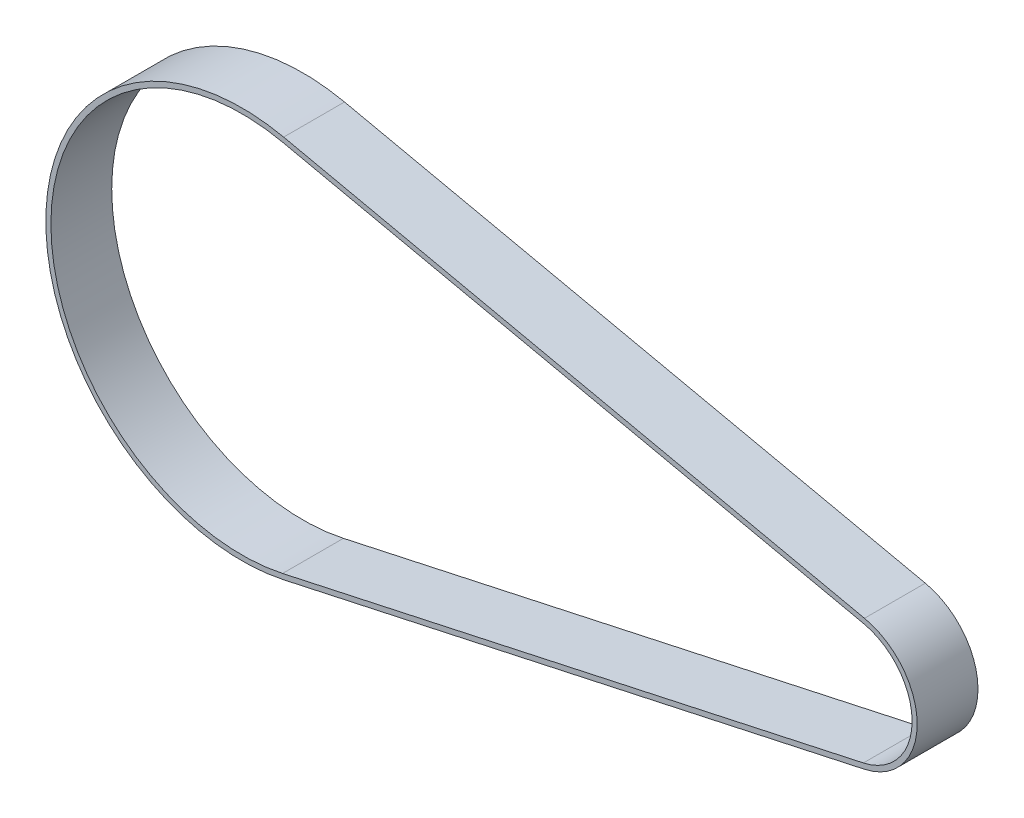
ISO-10303-21;
HEADER;
FILE_DESCRIPTION(('STEP AP214'),'2;1');
FILE_NAME('part.step','',(''),(''),'','','');
FILE_SCHEMA(('AUTOMOTIVE_DESIGN { 1 0 10303 214 1 1 1 1 }'));
ENDSEC;
DATA;
#1=APPLICATION_CONTEXT('core data for automotive mechanical design processes');
#2=APPLICATION_PROTOCOL_DEFINITION('international standard','automotive_design',2000,#1);
#3=PRODUCT_CONTEXT('',#1,'mechanical');
#4=PRODUCT('Part','Part','',(#3));
#5=PRODUCT_RELATED_PRODUCT_CATEGORY('part','',(#4));
#6=PRODUCT_DEFINITION_FORMATION('','',#4);
#7=PRODUCT_DEFINITION_CONTEXT('part definition',#1,'design');
#8=PRODUCT_DEFINITION('design','',#6,#7);
#9=PRODUCT_DEFINITION_SHAPE('','',#8);
#10=(LENGTH_UNIT() NAMED_UNIT(*) SI_UNIT(.MILLI.,.METRE.));
#11=(NAMED_UNIT(*) PLANE_ANGLE_UNIT() SI_UNIT($,.RADIAN.));
#12=(NAMED_UNIT(*) SI_UNIT($,.STERADIAN.) SOLID_ANGLE_UNIT());
#13=UNCERTAINTY_MEASURE_WITH_UNIT(LENGTH_MEASURE(1.E-05),#10,'distance_accuracy_value','');
#14=(GEOMETRIC_REPRESENTATION_CONTEXT(3) GLOBAL_UNCERTAINTY_ASSIGNED_CONTEXT((#13)) GLOBAL_UNIT_ASSIGNED_CONTEXT((#10,
#11,#12)) REPRESENTATION_CONTEXT('',''));
#15=CARTESIAN_POINT('',(0.,0.,0.));
#16=DIRECTION('',(0.,0.,1.));
#17=DIRECTION('',(1.,0.,0.));
#18=AXIS2_PLACEMENT_3D('',#15,#16,#17);
#19=CARTESIAN_POINT('',(0.,0.,6.));
#20=DIRECTION('',(0.,0.,1.));
#21=DIRECTION('',(1.,0.,0.));
#22=AXIS2_PLACEMENT_3D('',#19,#20,#21);
#23=PLANE('',#22);
#24=CARTESIAN_POINT('',(0.,0.,6.));
#25=DIRECTION('',(0.,0.,1.));
#26=DIRECTION('',(1.,0.,0.));
#27=AXIS2_PLACEMENT_3D('',#24,#25,#26);
#28=CIRCLE('',#27,19.35);
#29=CARTESIAN_POINT('',(4.111875,18.9080666379293,6.));
#30=VERTEX_POINT('',#29);
#31=CARTESIAN_POINT('',(4.111875,-18.9080666379293,6.));
#32=VERTEX_POINT('',#31);
#33=EDGE_CURVE('E134',#30,#32,#28,.T.);
#34=ORIENTED_EDGE('',*,*,#33,.T.);
#35=DIRECTION('',(0.977161066559654,0.2125,0.));
#36=VECTOR('',#35,1.);
#37=CARTESIAN_POINT('',(61.4025,-6.44926303929371,6.));
#38=LINE('',#37,#36);
#39=CARTESIAN_POINT('',(61.4025,-6.44926303929371,6.));
#40=VERTEX_POINT('',#39);
#41=EDGE_CURVE('E137',#32,#40,#38,.T.);
#42=ORIENTED_EDGE('',*,*,#41,.T.);
#43=CARTESIAN_POINT('',(60.,0.,6.));
#44=DIRECTION('',(0.,0.,1.));
#45=DIRECTION('',(1.,0.,0.));
#46=AXIS2_PLACEMENT_3D('',#43,#44,#45);
#47=CIRCLE('',#46,6.6);
#48=CARTESIAN_POINT('',(61.4025,6.44926303929371,6.));
#49=VERTEX_POINT('',#48);
#50=EDGE_CURVE('E140',#40,#49,#47,.T.);
#51=ORIENTED_EDGE('',*,*,#50,.T.);
#52=DIRECTION('',(-0.977161066559654,0.2125,0.));
#53=VECTOR('',#52,1.);
#54=CARTESIAN_POINT('',(4.111875,18.9080666379293,6.));
#55=LINE('',#54,#53);
#56=EDGE_CURVE('E142',#49,#30,#55,.T.);
#57=ORIENTED_EDGE('',*,*,#56,.T.);
#58=EDGE_LOOP('',(#34,#42,#51,#57));
#59=FACE_BOUND('',#58,.T.);
#60=DIRECTION('',(0.977161066559654,0.2125,0.));
#61=VECTOR('',#60,1.);
#62=CARTESIAN_POINT('',(61.29625,-5.96068250601389,6.));
#63=LINE('',#62,#61);
#64=CARTESIAN_POINT('',(4.005625,-18.4194861046495,6.));
#65=VERTEX_POINT('',#64);
#66=CARTESIAN_POINT('',(61.29625,-5.96068250601389,6.));
#67=VERTEX_POINT('',#66);
#68=EDGE_CURVE('E106',#65,#67,#63,.T.);
#69=ORIENTED_EDGE('',*,*,#68,.F.);
#70=CARTESIAN_POINT('',(0.,0.,6.));
#71=DIRECTION('',(0.,0.,1.));
#72=DIRECTION('',(1.,0.,0.));
#73=AXIS2_PLACEMENT_3D('',#70,#71,#72);
#74=CIRCLE('',#73,18.85);
#75=CARTESIAN_POINT('',(4.005625,18.4194861046495,6.));
#76=VERTEX_POINT('',#75);
#77=EDGE_CURVE('E98',#76,#65,#74,.T.);
#78=ORIENTED_EDGE('',*,*,#77,.F.);
#79=DIRECTION('',(-0.977161066559654,0.2125,0.));
#80=VECTOR('',#79,1.);
#81=CARTESIAN_POINT('',(4.005625,18.4194861046495,6.));
#82=LINE('',#81,#80);
#83=CARTESIAN_POINT('',(61.29625,5.96068250601389,6.));
#84=VERTEX_POINT('',#83);
#85=EDGE_CURVE('E120',#84,#76,#82,.T.);
#86=ORIENTED_EDGE('',*,*,#85,.F.);
#87=CARTESIAN_POINT('',(60.,0.,6.));
#88=DIRECTION('',(0.,0.,1.));
#89=DIRECTION('',(1.,0.,0.));
#90=AXIS2_PLACEMENT_3D('',#87,#88,#89);
#91=CIRCLE('',#90,6.1);
#92=EDGE_CURVE('E118',#67,#84,#91,.T.);
#93=ORIENTED_EDGE('',*,*,#92,.F.);
#94=EDGE_LOOP('',(#69,#78,#86,#93));
#95=FACE_BOUND('',#94,.T.);
#96=ADVANCED_FACE('F33',(#59,#95),#23,.T.);
#97=CARTESIAN_POINT('',(0.,0.,0.));
#98=DIRECTION('',(0.,0.,1.));
#99=DIRECTION('',(1.,0.,0.));
#100=AXIS2_PLACEMENT_3D('',#97,#98,#99);
#101=PLANE('',#100);
#102=CARTESIAN_POINT('',(0.,0.,0.));
#103=DIRECTION('',(0.,0.,1.));
#104=DIRECTION('',(1.,0.,0.));
#105=AXIS2_PLACEMENT_3D('',#102,#103,#104);
#106=CIRCLE('',#105,19.35);
#107=CARTESIAN_POINT('',(4.111875,18.9080666379293,0.));
#108=VERTEX_POINT('',#107);
#109=CARTESIAN_POINT('',(4.111875,-18.9080666379293,0.));
#110=VERTEX_POINT('',#109);
#111=EDGE_CURVE('E114',#108,#110,#106,.T.);
#112=ORIENTED_EDGE('',*,*,#111,.F.);
#113=DIRECTION('',(-0.977161066559654,0.2125,0.));
#114=VECTOR('',#113,1.);
#115=CARTESIAN_POINT('',(4.111875,18.9080666379293,0.));
#116=LINE('',#115,#114);
#117=CARTESIAN_POINT('',(61.4025,6.44926303929371,0.));
#118=VERTEX_POINT('',#117);
#119=EDGE_CURVE('E138',#118,#108,#116,.T.);
#120=ORIENTED_EDGE('',*,*,#119,.F.);
#121=CARTESIAN_POINT('',(60.,0.,0.));
#122=DIRECTION('',(0.,0.,1.));
#123=DIRECTION('',(1.,0.,0.));
#124=AXIS2_PLACEMENT_3D('',#121,#122,#123);
#125=CIRCLE('',#124,6.6);
#126=CARTESIAN_POINT('',(61.4025,-6.44926303929371,0.));
#127=VERTEX_POINT('',#126);
#128=EDGE_CURVE('E149',#127,#118,#125,.T.);
#129=ORIENTED_EDGE('',*,*,#128,.F.);
#130=DIRECTION('',(0.977161066559654,0.2125,0.));
#131=VECTOR('',#130,1.);
#132=CARTESIAN_POINT('',(61.4025,-6.44926303929371,0.));
#133=LINE('',#132,#131);
#134=EDGE_CURVE('E147',#110,#127,#133,.T.);
#135=ORIENTED_EDGE('',*,*,#134,.F.);
#136=EDGE_LOOP('',(#112,#120,#129,#135));
#137=FACE_BOUND('',#136,.T.);
#138=CARTESIAN_POINT('',(0.,0.,0.));
#139=DIRECTION('',(0.,0.,1.));
#140=DIRECTION('',(1.,0.,0.));
#141=AXIS2_PLACEMENT_3D('',#138,#139,#140);
#142=CIRCLE('',#141,18.85);
#143=CARTESIAN_POINT('',(4.005625,18.4194861046495,0.));
#144=VERTEX_POINT('',#143);
#145=CARTESIAN_POINT('',(4.005625,-18.4194861046495,0.));
#146=VERTEX_POINT('',#145);
#147=EDGE_CURVE('E56',#144,#146,#142,.T.);
#148=ORIENTED_EDGE('',*,*,#147,.T.);
#149=DIRECTION('',(0.977161066559654,0.2125,0.));
#150=VECTOR('',#149,1.);
#151=CARTESIAN_POINT('',(61.29625,-5.96068250601389,0.));
#152=LINE('',#151,#150);
#153=CARTESIAN_POINT('',(61.29625,-5.96068250601389,0.));
#154=VERTEX_POINT('',#153);
#155=EDGE_CURVE('E113',#146,#154,#152,.T.);
#156=ORIENTED_EDGE('',*,*,#155,.T.);
#157=CARTESIAN_POINT('',(60.,0.,0.));
#158=DIRECTION('',(0.,0.,1.));
#159=DIRECTION('',(1.,0.,0.));
#160=AXIS2_PLACEMENT_3D('',#157,#158,#159);
#161=CIRCLE('',#160,6.1);
#162=CARTESIAN_POINT('',(61.29625,5.96068250601389,0.));
#163=VERTEX_POINT('',#162);
#164=EDGE_CURVE('E126',#154,#163,#161,.T.);
#165=ORIENTED_EDGE('',*,*,#164,.T.);
#166=DIRECTION('',(-0.977161066559654,0.2125,0.));
#167=VECTOR('',#166,1.);
#168=CARTESIAN_POINT('',(4.005625,18.4194861046495,0.));
#169=LINE('',#168,#167);
#170=EDGE_CURVE('E107',#163,#144,#169,.T.);
#171=ORIENTED_EDGE('',*,*,#170,.T.);
#172=EDGE_LOOP('',(#148,#156,#165,#171));
#173=FACE_BOUND('',#172,.T.);
#174=ADVANCED_FACE('F167',(#137,#173),#101,.F.);
#175=CARTESIAN_POINT('',(0.,0.,6.));
#176=DIRECTION('',(0.,0.,-1.));
#177=DIRECTION('',(-1.,0.,0.));
#178=AXIS2_PLACEMENT_3D('',#175,#176,#177);
#179=CYLINDRICAL_SURFACE('',#178,19.35);
#180=ORIENTED_EDGE('',*,*,#111,.T.);
#181=DIRECTION('',(0.,0.,-1.));
#182=VECTOR('',#181,1.);
#183=CARTESIAN_POINT('',(4.111875,-18.9080666379293,6.));
#184=LINE('',#183,#182);
#185=EDGE_CURVE('E11',#32,#110,#184,.T.);
#186=ORIENTED_EDGE('',*,*,#185,.F.);
#187=ORIENTED_EDGE('',*,*,#33,.F.);
#188=DIRECTION('',(0.,0.,-1.));
#189=VECTOR('',#188,1.);
#190=CARTESIAN_POINT('',(4.111875,18.9080666379293,6.));
#191=LINE('',#190,#189);
#192=EDGE_CURVE('E144',#30,#108,#191,.T.);
#193=ORIENTED_EDGE('',*,*,#192,.T.);
#194=EDGE_LOOP('',(#180,#186,#187,#193));
#195=FACE_BOUND('',#194,.T.);
#196=ADVANCED_FACE('F35',(#195),#179,.T.);
#197=CARTESIAN_POINT('',(61.4025,-6.44926303929371,6.));
#198=DIRECTION('',(-0.2125,0.977161066559654,0.));
#199=DIRECTION('',(-0.977161066559654,-0.2125,0.));
#200=AXIS2_PLACEMENT_3D('',#197,#198,#199);
#201=PLANE('',#200);
#202=ORIENTED_EDGE('',*,*,#134,.T.);
#203=DIRECTION('',(0.,0.,-1.));
#204=VECTOR('',#203,1.);
#205=CARTESIAN_POINT('',(61.4025,-6.44926303929371,6.));
#206=LINE('',#205,#204);
#207=EDGE_CURVE('E41',#40,#127,#206,.T.);
#208=ORIENTED_EDGE('',*,*,#207,.F.);
#209=ORIENTED_EDGE('',*,*,#41,.F.);
#210=ORIENTED_EDGE('',*,*,#185,.T.);
#211=EDGE_LOOP('',(#202,#208,#209,#210));
#212=FACE_BOUND('',#211,.T.);
#213=ADVANCED_FACE('F177',(#212),#201,.F.);
#214=CARTESIAN_POINT('',(60.,0.,6.));
#215=DIRECTION('',(0.,0.,-1.));
#216=DIRECTION('',(-1.,0.,0.));
#217=AXIS2_PLACEMENT_3D('',#214,#215,#216);
#218=CYLINDRICAL_SURFACE('',#217,6.6);
#219=ORIENTED_EDGE('',*,*,#128,.T.);
#220=DIRECTION('',(0.,0.,-1.));
#221=VECTOR('',#220,1.);
#222=CARTESIAN_POINT('',(61.4025,6.44926303929371,6.));
#223=LINE('',#222,#221);
#224=EDGE_CURVE('E154',#49,#118,#223,.T.);
#225=ORIENTED_EDGE('',*,*,#224,.F.);
#226=ORIENTED_EDGE('',*,*,#50,.F.);
#227=ORIENTED_EDGE('',*,*,#207,.T.);
#228=EDGE_LOOP('',(#219,#225,#226,#227));
#229=FACE_BOUND('',#228,.T.);
#230=ADVANCED_FACE('F161',(#229),#218,.T.);
#231=CARTESIAN_POINT('',(4.111875,18.9080666379293,6.));
#232=DIRECTION('',(-0.2125,-0.977161066559654,0.));
#233=DIRECTION('',(0.977161066559654,-0.2125,0.));
#234=AXIS2_PLACEMENT_3D('',#231,#232,#233);
#235=PLANE('',#234);
#236=ORIENTED_EDGE('',*,*,#119,.T.);
#237=ORIENTED_EDGE('',*,*,#192,.F.);
#238=ORIENTED_EDGE('',*,*,#56,.F.);
#239=ORIENTED_EDGE('',*,*,#224,.T.);
#240=EDGE_LOOP('',(#236,#237,#238,#239));
#241=FACE_BOUND('',#240,.T.);
#242=ADVANCED_FACE('F171',(#241),#235,.F.);
#243=CARTESIAN_POINT('',(0.,0.,6.));
#244=DIRECTION('',(0.,0.,-1.));
#245=DIRECTION('',(-1.,0.,0.));
#246=AXIS2_PLACEMENT_3D('',#243,#244,#245);
#247=CYLINDRICAL_SURFACE('',#246,18.85);
#248=ORIENTED_EDGE('',*,*,#147,.F.);
#249=DIRECTION('',(0.,0.,-1.));
#250=VECTOR('',#249,1.);
#251=CARTESIAN_POINT('',(4.005625,18.4194861046495,6.));
#252=LINE('',#251,#250);
#253=EDGE_CURVE('E102',#76,#144,#252,.T.);
#254=ORIENTED_EDGE('',*,*,#253,.F.);
#255=ORIENTED_EDGE('',*,*,#77,.T.);
#256=DIRECTION('',(0.,0.,-1.));
#257=VECTOR('',#256,1.);
#258=CARTESIAN_POINT('',(4.005625,-18.4194861046495,6.));
#259=LINE('',#258,#257);
#260=EDGE_CURVE('E101',#65,#146,#259,.T.);
#261=ORIENTED_EDGE('',*,*,#260,.T.);
#262=EDGE_LOOP('',(#248,#254,#255,#261));
#263=FACE_BOUND('',#262,.T.);
#264=ADVANCED_FACE('F100',(#263),#247,.F.);
#265=CARTESIAN_POINT('',(61.29625,-5.96068250601389,6.));
#266=DIRECTION('',(-0.2125,0.977161066559654,0.));
#267=DIRECTION('',(-0.977161066559654,-0.2125,0.));
#268=AXIS2_PLACEMENT_3D('',#265,#266,#267);
#269=PLANE('',#268);
#270=ORIENTED_EDGE('',*,*,#155,.F.);
#271=ORIENTED_EDGE('',*,*,#260,.F.);
#272=ORIENTED_EDGE('',*,*,#68,.T.);
#273=DIRECTION('',(0.,0.,-1.));
#274=VECTOR('',#273,1.);
#275=CARTESIAN_POINT('',(61.29625,-5.96068250601389,6.));
#276=LINE('',#275,#274);
#277=EDGE_CURVE('E115',#67,#154,#276,.T.);
#278=ORIENTED_EDGE('',*,*,#277,.T.);
#279=EDGE_LOOP('',(#270,#271,#272,#278));
#280=FACE_BOUND('',#279,.T.);
#281=ADVANCED_FACE('F110',(#280),#269,.T.);
#282=CARTESIAN_POINT('',(60.,0.,6.));
#283=DIRECTION('',(0.,0.,-1.));
#284=DIRECTION('',(-1.,0.,0.));
#285=AXIS2_PLACEMENT_3D('',#282,#283,#284);
#286=CYLINDRICAL_SURFACE('',#285,6.1);
#287=ORIENTED_EDGE('',*,*,#164,.F.);
#288=ORIENTED_EDGE('',*,*,#277,.F.);
#289=ORIENTED_EDGE('',*,*,#92,.T.);
#290=DIRECTION('',(0.,0.,-1.));
#291=VECTOR('',#290,1.);
#292=CARTESIAN_POINT('',(61.29625,5.96068250601389,6.));
#293=LINE('',#292,#291);
#294=EDGE_CURVE('E48',#84,#163,#293,.T.);
#295=ORIENTED_EDGE('',*,*,#294,.T.);
#296=EDGE_LOOP('',(#287,#288,#289,#295));
#297=FACE_BOUND('',#296,.T.);
#298=ADVANCED_FACE('F200',(#297),#286,.F.);
#299=CARTESIAN_POINT('',(4.005625,18.4194861046495,6.));
#300=DIRECTION('',(-0.2125,-0.977161066559654,0.));
#301=DIRECTION('',(0.977161066559654,-0.2125,0.));
#302=AXIS2_PLACEMENT_3D('',#299,#300,#301);
#303=PLANE('',#302);
#304=ORIENTED_EDGE('',*,*,#170,.F.);
#305=ORIENTED_EDGE('',*,*,#294,.F.);
#306=ORIENTED_EDGE('',*,*,#85,.T.);
#307=ORIENTED_EDGE('',*,*,#253,.T.);
#308=EDGE_LOOP('',(#304,#305,#306,#307));
#309=FACE_BOUND('',#308,.T.);
#310=ADVANCED_FACE('F204',(#309),#303,.T.);
#311=CLOSED_SHELL('',(#96,#174,#196,#213,#230,#242,#264,#281,#298,#310));
#312=MANIFOLD_SOLID_BREP('B2',#311);
#313=ADVANCED_BREP_SHAPE_REPRESENTATION('',(#18,#312),#14);
#314=SHAPE_DEFINITION_REPRESENTATION(#9,#313);
ENDSEC;
END-ISO-10303-21;
